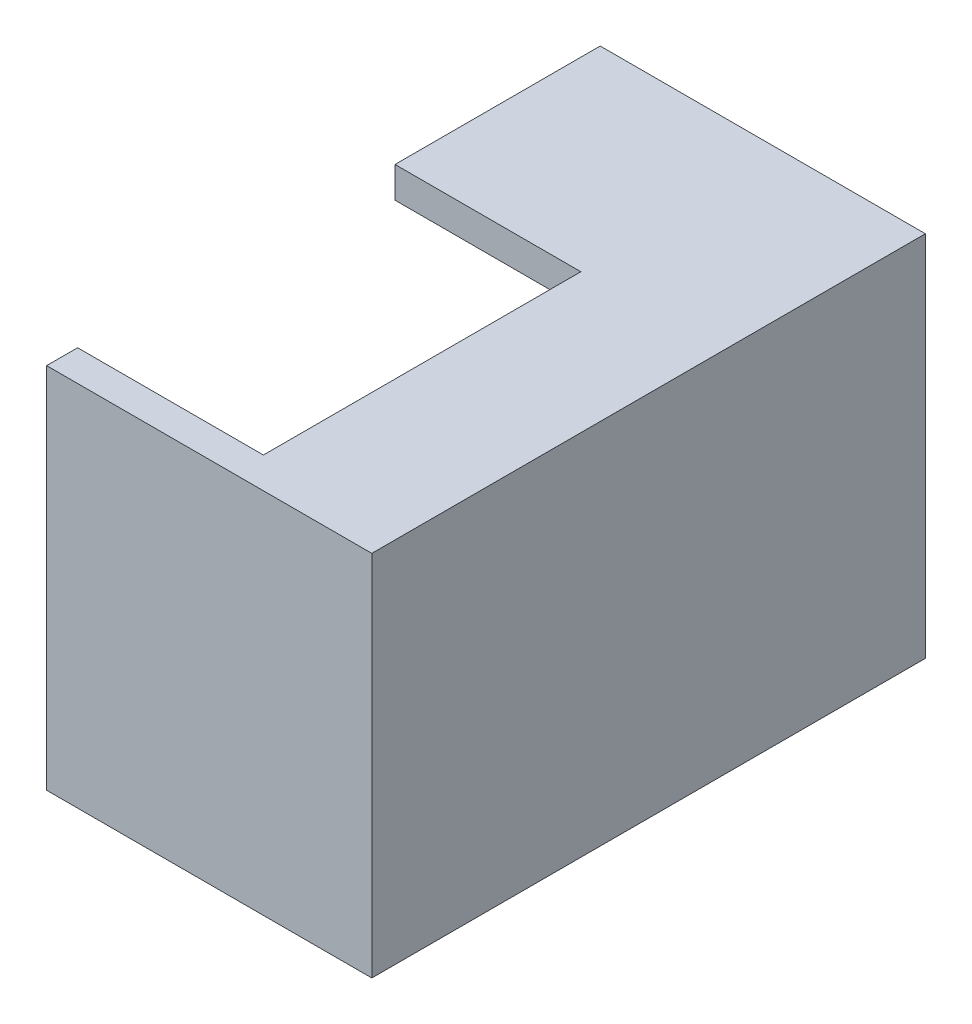
ISO-10303-21;
HEADER;
FILE_DESCRIPTION(('STEP AP214'),'2;1');
FILE_NAME('part.step','',(''),(''),'','','');
FILE_SCHEMA(('AUTOMOTIVE_DESIGN { 1 0 10303 214 1 1 1 1 }'));
ENDSEC;
DATA;
#1=APPLICATION_CONTEXT('core data for automotive mechanical design processes');
#2=APPLICATION_PROTOCOL_DEFINITION('international standard','automotive_design',2000,#1);
#3=PRODUCT_CONTEXT('',#1,'mechanical');
#4=PRODUCT('Part','Part','',(#3));
#5=PRODUCT_RELATED_PRODUCT_CATEGORY('part','',(#4));
#6=PRODUCT_DEFINITION_FORMATION('','',#4);
#7=PRODUCT_DEFINITION_CONTEXT('part definition',#1,'design');
#8=PRODUCT_DEFINITION('design','',#6,#7);
#9=PRODUCT_DEFINITION_SHAPE('','',#8);
#10=(LENGTH_UNIT() NAMED_UNIT(*) SI_UNIT(.MILLI.,.METRE.));
#11=(NAMED_UNIT(*) PLANE_ANGLE_UNIT() SI_UNIT($,.RADIAN.));
#12=(NAMED_UNIT(*) SI_UNIT($,.STERADIAN.) SOLID_ANGLE_UNIT());
#13=UNCERTAINTY_MEASURE_WITH_UNIT(LENGTH_MEASURE(1.E-05),#10,'distance_accuracy_value','');
#14=(GEOMETRIC_REPRESENTATION_CONTEXT(3) GLOBAL_UNCERTAINTY_ASSIGNED_CONTEXT((#13)) GLOBAL_UNIT_ASSIGNED_CONTEXT((#10,
#11,#12)) REPRESENTATION_CONTEXT('',''));
#15=CARTESIAN_POINT('',(0.,0.,0.));
#16=DIRECTION('',(0.,0.,1.));
#17=DIRECTION('',(1.,0.,0.));
#18=AXIS2_PLACEMENT_3D('',#15,#16,#17);
#19=CARTESIAN_POINT('',(19.,9.875,-17.875));
#20=DIRECTION('',(0.,0.,1.));
#21=DIRECTION('',(1.,0.,0.));
#22=AXIS2_PLACEMENT_3D('',#19,#20,#21);
#23=PLANE('',#22);
#24=DIRECTION('',(0.,1.,0.));
#25=VECTOR('',#24,1.);
#26=CARTESIAN_POINT('',(0.,9.875,-17.875));
#27=LINE('',#26,#25);
#28=CARTESIAN_POINT('',(0.,-11.875,-17.875));
#29=VERTEX_POINT('',#28);
#30=CARTESIAN_POINT('',(0.,11.875,-17.875));
#31=VERTEX_POINT('',#30);
#32=EDGE_CURVE('E149',#29,#31,#27,.T.);
#33=ORIENTED_EDGE('',*,*,#32,.T.);
#34=DIRECTION('',(-1.,0.,0.));
#35=VECTOR('',#34,1.);
#36=CARTESIAN_POINT('',(19.,11.875,-17.875));
#37=LINE('',#36,#35);
#38=CARTESIAN_POINT('',(21.,11.875,-17.875));
#39=VERTEX_POINT('',#38);
#40=EDGE_CURVE('E11',#39,#31,#37,.T.);
#41=ORIENTED_EDGE('',*,*,#40,.F.);
#42=DIRECTION('',(0.,1.,0.));
#43=VECTOR('',#42,1.);
#44=CARTESIAN_POINT('',(21.,9.875,-17.875));
#45=LINE('',#44,#43);
#46=CARTESIAN_POINT('',(21.,-11.875,-17.875));
#47=VERTEX_POINT('',#46);
#48=EDGE_CURVE('E124',#47,#39,#45,.T.);
#49=ORIENTED_EDGE('',*,*,#48,.F.);
#50=DIRECTION('',(-1.,0.,0.));
#51=VECTOR('',#50,1.);
#52=CARTESIAN_POINT('',(19.,-11.875,-17.875));
#53=LINE('',#52,#51);
#54=EDGE_CURVE('E145',#47,#29,#53,.T.);
#55=ORIENTED_EDGE('',*,*,#54,.T.);
#56=EDGE_LOOP('',(#33,#41,#49,#55));
#57=FACE_BOUND('',#56,.T.);
#58=ADVANCED_FACE('F43',(#57),#23,.F.);
#59=CARTESIAN_POINT('',(19.,11.875,15.875));
#60=DIRECTION('',(0.,-1.,0.));
#61=DIRECTION('',(0.,0.,-1.));
#62=AXIS2_PLACEMENT_3D('',#59,#60,#61);
#63=PLANE('',#62);
#64=DIRECTION('',(0.,0.,-1.));
#65=VECTOR('',#64,1.);
#66=CARTESIAN_POINT('',(12.,11.875,-4.625));
#67=LINE('',#66,#65);
#68=CARTESIAN_POINT('',(12.,11.875,15.875));
#69=VERTEX_POINT('',#68);
#70=CARTESIAN_POINT('',(12.,11.875,-4.625));
#71=VERTEX_POINT('',#70);
#72=EDGE_CURVE('E225',#69,#71,#67,.T.);
#73=ORIENTED_EDGE('',*,*,#72,.F.);
#74=DIRECTION('',(1.,0.,0.));
#75=VECTOR('',#74,1.);
#76=CARTESIAN_POINT('',(12.,11.875,15.875));
#77=LINE('',#76,#75);
#78=CARTESIAN_POINT('',(0.,11.875,15.875));
#79=VERTEX_POINT('',#78);
#80=EDGE_CURVE('E229',#79,#69,#77,.T.);
#81=ORIENTED_EDGE('',*,*,#80,.F.);
#82=DIRECTION('',(0.,0.,1.));
#83=VECTOR('',#82,1.);
#84=CARTESIAN_POINT('',(0.,11.875,15.875));
#85=LINE('',#84,#83);
#86=CARTESIAN_POINT('',(0.,11.875,17.875));
#87=VERTEX_POINT('',#86);
#88=EDGE_CURVE('E134',#79,#87,#85,.T.);
#89=ORIENTED_EDGE('',*,*,#88,.T.);
#90=DIRECTION('',(-1.,0.,0.));
#91=VECTOR('',#90,1.);
#92=CARTESIAN_POINT('',(19.,11.875,17.875));
#93=LINE('',#92,#91);
#94=CARTESIAN_POINT('',(21.,11.875,17.875));
#95=VERTEX_POINT('',#94);
#96=EDGE_CURVE('E53',#95,#87,#93,.T.);
#97=ORIENTED_EDGE('',*,*,#96,.F.);
#98=DIRECTION('',(0.,0.,1.));
#99=VECTOR('',#98,1.);
#100=CARTESIAN_POINT('',(21.,11.875,15.875));
#101=LINE('',#100,#99);
#102=EDGE_CURVE('E118',#39,#95,#101,.T.);
#103=ORIENTED_EDGE('',*,*,#102,.F.);
#104=ORIENTED_EDGE('',*,*,#40,.T.);
#105=CARTESIAN_POINT('',(0.,11.875,-4.625));
#106=VERTEX_POINT('',#105);
#107=EDGE_CURVE('E47',#31,#106,#85,.T.);
#108=ORIENTED_EDGE('',*,*,#107,.T.);
#109=DIRECTION('',(-1.,0.,0.));
#110=VECTOR('',#109,1.);
#111=CARTESIAN_POINT('',(0.,11.875,-4.625));
#112=LINE('',#111,#110);
#113=EDGE_CURVE('E221',#71,#106,#112,.T.);
#114=ORIENTED_EDGE('',*,*,#113,.F.);
#115=EDGE_LOOP('',(#73,#81,#89,#97,#103,#104,#108,#114));
#116=FACE_BOUND('',#115,.T.);
#117=ADVANCED_FACE('F131',(#116),#63,.F.);
#118=CARTESIAN_POINT('',(19.,9.875,17.875));
#119=DIRECTION('',(0.,0.,-1.));
#120=DIRECTION('',(0.,1.,0.));
#121=AXIS2_PLACEMENT_3D('',#118,#119,#120);
#122=PLANE('',#121);
#123=DIRECTION('',(0.,-1.,0.));
#124=VECTOR('',#123,1.);
#125=CARTESIAN_POINT('',(0.,9.875,17.875));
#126=LINE('',#125,#124);
#127=CARTESIAN_POINT('',(0.,-11.875,17.875));
#128=VERTEX_POINT('',#127);
#129=EDGE_CURVE('E156',#87,#128,#126,.T.);
#130=ORIENTED_EDGE('',*,*,#129,.T.);
#131=DIRECTION('',(-1.,0.,0.));
#132=VECTOR('',#131,1.);
#133=CARTESIAN_POINT('',(19.,-11.875,17.875));
#134=LINE('',#133,#132);
#135=CARTESIAN_POINT('',(21.,-11.875,17.875));
#136=VERTEX_POINT('',#135);
#137=EDGE_CURVE('E138',#136,#128,#134,.T.);
#138=ORIENTED_EDGE('',*,*,#137,.F.);
#139=DIRECTION('',(0.,-1.,0.));
#140=VECTOR('',#139,1.);
#141=CARTESIAN_POINT('',(21.,9.875,17.875));
#142=LINE('',#141,#140);
#143=EDGE_CURVE('E121',#95,#136,#142,.T.);
#144=ORIENTED_EDGE('',*,*,#143,.F.);
#145=ORIENTED_EDGE('',*,*,#96,.T.);
#146=EDGE_LOOP('',(#130,#138,#144,#145));
#147=FACE_BOUND('',#146,.T.);
#148=ADVANCED_FACE('F140',(#147),#122,.F.);
#149=CARTESIAN_POINT('',(19.,-11.875,15.875));
#150=DIRECTION('',(0.,1.,0.));
#151=DIRECTION('',(0.,0.,1.));
#152=AXIS2_PLACEMENT_3D('',#149,#150,#151);
#153=PLANE('',#152);
#154=DIRECTION('',(0.,0.,-1.));
#155=VECTOR('',#154,1.);
#156=CARTESIAN_POINT('',(0.,-11.875,15.875));
#157=LINE('',#156,#155);
#158=EDGE_CURVE('E154',#128,#29,#157,.T.);
#159=ORIENTED_EDGE('',*,*,#158,.T.);
#160=ORIENTED_EDGE('',*,*,#54,.F.);
#161=DIRECTION('',(0.,0.,-1.));
#162=VECTOR('',#161,1.);
#163=CARTESIAN_POINT('',(21.,-11.875,15.875));
#164=LINE('',#163,#162);
#165=EDGE_CURVE('E70',#136,#47,#164,.T.);
#166=ORIENTED_EDGE('',*,*,#165,.F.);
#167=ORIENTED_EDGE('',*,*,#137,.T.);
#168=EDGE_LOOP('',(#159,#160,#166,#167));
#169=FACE_BOUND('',#168,.T.);
#170=ADVANCED_FACE('F243',(#169),#153,.F.);
#171=CARTESIAN_POINT('',(21.,0.,0.));
#172=DIRECTION('',(1.,0.,0.));
#173=DIRECTION('',(0.,0.,-1.));
#174=AXIS2_PLACEMENT_3D('',#171,#172,#173);
#175=PLANE('',#174);
#176=ORIENTED_EDGE('',*,*,#48,.T.);
#177=ORIENTED_EDGE('',*,*,#102,.T.);
#178=ORIENTED_EDGE('',*,*,#143,.T.);
#179=ORIENTED_EDGE('',*,*,#165,.T.);
#180=EDGE_LOOP('',(#176,#177,#178,#179));
#181=FACE_BOUND('',#180,.T.);
#182=ADVANCED_FACE('F45',(#181),#175,.T.);
#183=CARTESIAN_POINT('',(0.,0.,0.));
#184=DIRECTION('',(1.,0.,0.));
#185=DIRECTION('',(0.,0.,-1.));
#186=AXIS2_PLACEMENT_3D('',#183,#184,#185);
#187=PLANE('',#186);
#188=ORIENTED_EDGE('',*,*,#88,.F.);
#189=DIRECTION('',(0.,-1.,0.));
#190=VECTOR('',#189,1.);
#191=CARTESIAN_POINT('',(0.,9.875,15.875));
#192=LINE('',#191,#190);
#193=CARTESIAN_POINT('',(0.,-9.875,15.875));
#194=VERTEX_POINT('',#193);
#195=EDGE_CURVE('E192',#79,#194,#192,.T.);
#196=ORIENTED_EDGE('',*,*,#195,.T.);
#197=DIRECTION('',(0.,0.,-1.));
#198=VECTOR('',#197,1.);
#199=CARTESIAN_POINT('',(0.,-9.875,15.875));
#200=LINE('',#199,#198);
#201=CARTESIAN_POINT('',(0.,-9.875,-15.875));
#202=VERTEX_POINT('',#201);
#203=EDGE_CURVE('E188',#194,#202,#200,.T.);
#204=ORIENTED_EDGE('',*,*,#203,.T.);
#205=DIRECTION('',(0.,1.,0.));
#206=VECTOR('',#205,1.);
#207=CARTESIAN_POINT('',(0.,9.875,-15.875));
#208=LINE('',#207,#206);
#209=CARTESIAN_POINT('',(0.,9.875,-15.875));
#210=VERTEX_POINT('',#209);
#211=EDGE_CURVE('E200',#202,#210,#208,.T.);
#212=ORIENTED_EDGE('',*,*,#211,.T.);
#213=DIRECTION('',(0.,0.,1.));
#214=VECTOR('',#213,1.);
#215=CARTESIAN_POINT('',(0.,9.875,15.875));
#216=LINE('',#215,#214);
#217=CARTESIAN_POINT('',(0.,9.875,-4.625));
#218=VERTEX_POINT('',#217);
#219=EDGE_CURVE('E196',#210,#218,#216,.T.);
#220=ORIENTED_EDGE('',*,*,#219,.T.);
#221=DIRECTION('',(0.,1.,0.));
#222=VECTOR('',#221,1.);
#223=CARTESIAN_POINT('',(0.,-13.8789470404394,-4.625));
#224=LINE('',#223,#222);
#225=EDGE_CURVE('E204',#218,#106,#224,.T.);
#226=ORIENTED_EDGE('',*,*,#225,.T.);
#227=ORIENTED_EDGE('',*,*,#107,.F.);
#228=ORIENTED_EDGE('',*,*,#32,.F.);
#229=ORIENTED_EDGE('',*,*,#158,.F.);
#230=ORIENTED_EDGE('',*,*,#129,.F.);
#231=EDGE_LOOP('',(#188,#196,#204,#212,#220,#226,#227,#228,#229,#230));
#232=FACE_BOUND('',#231,.T.);
#233=ADVANCED_FACE('F244',(#232),#187,.F.);
#234=CARTESIAN_POINT('',(19.,9.875,-15.875));
#235=DIRECTION('',(0.,0.,1.));
#236=DIRECTION('',(1.,0.,0.));
#237=AXIS2_PLACEMENT_3D('',#234,#235,#236);
#238=PLANE('',#237);
#239=ORIENTED_EDGE('',*,*,#211,.F.);
#240=DIRECTION('',(-1.,0.,0.));
#241=VECTOR('',#240,1.);
#242=CARTESIAN_POINT('',(19.,-9.875,-15.875));
#243=LINE('',#242,#241);
#244=CARTESIAN_POINT('',(19.,-9.875,-15.875));
#245=VERTEX_POINT('',#244);
#246=EDGE_CURVE('E172',#245,#202,#243,.T.);
#247=ORIENTED_EDGE('',*,*,#246,.F.);
#248=DIRECTION('',(0.,1.,0.));
#249=VECTOR('',#248,1.);
#250=CARTESIAN_POINT('',(19.,9.875,-15.875));
#251=LINE('',#250,#249);
#252=CARTESIAN_POINT('',(19.,9.875,-15.875));
#253=VERTEX_POINT('',#252);
#254=EDGE_CURVE('E184',#245,#253,#251,.T.);
#255=ORIENTED_EDGE('',*,*,#254,.T.);
#256=DIRECTION('',(-1.,0.,0.));
#257=VECTOR('',#256,1.);
#258=CARTESIAN_POINT('',(19.,9.875,-15.875));
#259=LINE('',#258,#257);
#260=EDGE_CURVE('E153',#253,#210,#259,.T.);
#261=ORIENTED_EDGE('',*,*,#260,.T.);
#262=EDGE_LOOP('',(#239,#247,#255,#261));
#263=FACE_BOUND('',#262,.T.);
#264=ADVANCED_FACE('F262',(#263),#238,.T.);
#265=CARTESIAN_POINT('',(19.,9.875,15.875));
#266=DIRECTION('',(0.,-1.,0.));
#267=DIRECTION('',(0.,0.,-1.));
#268=AXIS2_PLACEMENT_3D('',#265,#266,#267);
#269=PLANE('',#268);
#270=DIRECTION('',(0.,0.,-1.));
#271=VECTOR('',#270,1.);
#272=CARTESIAN_POINT('',(12.,9.875,-4.625));
#273=LINE('',#272,#271);
#274=CARTESIAN_POINT('',(12.,9.875,15.875));
#275=VERTEX_POINT('',#274);
#276=CARTESIAN_POINT('',(12.,9.875,-4.625));
#277=VERTEX_POINT('',#276);
#278=EDGE_CURVE('E215',#275,#277,#273,.T.);
#279=ORIENTED_EDGE('',*,*,#278,.T.);
#280=DIRECTION('',(-1.,0.,0.));
#281=VECTOR('',#280,1.);
#282=CARTESIAN_POINT('',(0.,9.875,-4.625));
#283=LINE('',#282,#281);
#284=EDGE_CURVE('E207',#277,#218,#283,.T.);
#285=ORIENTED_EDGE('',*,*,#284,.T.);
#286=ORIENTED_EDGE('',*,*,#219,.F.);
#287=ORIENTED_EDGE('',*,*,#260,.F.);
#288=DIRECTION('',(0.,0.,1.));
#289=VECTOR('',#288,1.);
#290=CARTESIAN_POINT('',(19.,9.875,15.875));
#291=LINE('',#290,#289);
#292=CARTESIAN_POINT('',(19.,9.875,15.875));
#293=VERTEX_POINT('',#292);
#294=EDGE_CURVE('E180',#253,#293,#291,.T.);
#295=ORIENTED_EDGE('',*,*,#294,.T.);
#296=DIRECTION('',(-1.,0.,0.));
#297=VECTOR('',#296,1.);
#298=CARTESIAN_POINT('',(19.,9.875,15.875));
#299=LINE('',#298,#297);
#300=EDGE_CURVE('E165',#293,#275,#299,.T.);
#301=ORIENTED_EDGE('',*,*,#300,.T.);
#302=EDGE_LOOP('',(#279,#285,#286,#287,#295,#301));
#303=FACE_BOUND('',#302,.T.);
#304=ADVANCED_FACE('F266',(#303),#269,.T.);
#305=CARTESIAN_POINT('',(19.,9.875,15.875));
#306=DIRECTION('',(0.,0.,-1.));
#307=DIRECTION('',(0.,1.,0.));
#308=AXIS2_PLACEMENT_3D('',#305,#306,#307);
#309=PLANE('',#308);
#310=ORIENTED_EDGE('',*,*,#195,.F.);
#311=ORIENTED_EDGE('',*,*,#80,.T.);
#312=DIRECTION('',(0.,1.,0.));
#313=VECTOR('',#312,1.);
#314=CARTESIAN_POINT('',(12.,-13.8789470404394,15.875));
#315=LINE('',#314,#313);
#316=EDGE_CURVE('E61',#275,#69,#315,.T.);
#317=ORIENTED_EDGE('',*,*,#316,.F.);
#318=ORIENTED_EDGE('',*,*,#300,.F.);
#319=DIRECTION('',(0.,-1.,0.));
#320=VECTOR('',#319,1.);
#321=CARTESIAN_POINT('',(19.,9.875,15.875));
#322=LINE('',#321,#320);
#323=CARTESIAN_POINT('',(19.,-9.875,15.875));
#324=VERTEX_POINT('',#323);
#325=EDGE_CURVE('E177',#293,#324,#322,.T.);
#326=ORIENTED_EDGE('',*,*,#325,.T.);
#327=DIRECTION('',(-1.,0.,0.));
#328=VECTOR('',#327,1.);
#329=CARTESIAN_POINT('',(19.,-9.875,15.875));
#330=LINE('',#329,#328);
#331=EDGE_CURVE('E169',#324,#194,#330,.T.);
#332=ORIENTED_EDGE('',*,*,#331,.T.);
#333=EDGE_LOOP('',(#310,#311,#317,#318,#326,#332));
#334=FACE_BOUND('',#333,.T.);
#335=ADVANCED_FACE('F271',(#334),#309,.T.);
#336=CARTESIAN_POINT('',(19.,-9.875,15.875));
#337=DIRECTION('',(0.,1.,0.));
#338=DIRECTION('',(0.,0.,1.));
#339=AXIS2_PLACEMENT_3D('',#336,#337,#338);
#340=PLANE('',#339);
#341=ORIENTED_EDGE('',*,*,#203,.F.);
#342=ORIENTED_EDGE('',*,*,#331,.F.);
#343=DIRECTION('',(0.,0.,-1.));
#344=VECTOR('',#343,1.);
#345=CARTESIAN_POINT('',(19.,-9.875,15.875));
#346=LINE('',#345,#344);
#347=EDGE_CURVE('E99',#324,#245,#346,.T.);
#348=ORIENTED_EDGE('',*,*,#347,.T.);
#349=ORIENTED_EDGE('',*,*,#246,.T.);
#350=EDGE_LOOP('',(#341,#342,#348,#349));
#351=FACE_BOUND('',#350,.T.);
#352=ADVANCED_FACE('F278',(#351),#340,.T.);
#353=CARTESIAN_POINT('',(19.,0.,0.));
#354=DIRECTION('',(1.,0.,0.));
#355=DIRECTION('',(0.,0.,-1.));
#356=AXIS2_PLACEMENT_3D('',#353,#354,#355);
#357=PLANE('',#356);
#358=ORIENTED_EDGE('',*,*,#254,.F.);
#359=ORIENTED_EDGE('',*,*,#347,.F.);
#360=ORIENTED_EDGE('',*,*,#325,.F.);
#361=ORIENTED_EDGE('',*,*,#294,.F.);
#362=EDGE_LOOP('',(#358,#359,#360,#361));
#363=FACE_BOUND('',#362,.T.);
#364=ADVANCED_FACE('F281',(#363),#357,.F.);
#365=CARTESIAN_POINT('',(12.,-13.8789470404394,-4.625));
#366=DIRECTION('',(1.,0.,0.));
#367=DIRECTION('',(0.,0.,-1.));
#368=AXIS2_PLACEMENT_3D('',#365,#366,#367);
#369=PLANE('',#368);
#370=ORIENTED_EDGE('',*,*,#316,.T.);
#371=ORIENTED_EDGE('',*,*,#72,.T.);
#372=DIRECTION('',(0.,1.,0.));
#373=VECTOR('',#372,1.);
#374=CARTESIAN_POINT('',(12.,-13.8789470404394,-4.625));
#375=LINE('',#374,#373);
#376=EDGE_CURVE('E211',#277,#71,#375,.T.);
#377=ORIENTED_EDGE('',*,*,#376,.F.);
#378=ORIENTED_EDGE('',*,*,#278,.F.);
#379=EDGE_LOOP('',(#370,#371,#377,#378));
#380=FACE_BOUND('',#379,.T.);
#381=ADVANCED_FACE('F284',(#380),#369,.F.);
#382=CARTESIAN_POINT('',(0.,-13.8789470404394,-4.625));
#383=DIRECTION('',(0.,0.,-1.));
#384=DIRECTION('',(-1.,0.,0.));
#385=AXIS2_PLACEMENT_3D('',#382,#383,#384);
#386=PLANE('',#385);
#387=ORIENTED_EDGE('',*,*,#376,.T.);
#388=ORIENTED_EDGE('',*,*,#113,.T.);
#389=ORIENTED_EDGE('',*,*,#225,.F.);
#390=ORIENTED_EDGE('',*,*,#284,.F.);
#391=EDGE_LOOP('',(#387,#388,#389,#390));
#392=FACE_BOUND('',#391,.T.);
#393=ADVANCED_FACE('F288',(#392),#386,.F.);
#394=CLOSED_SHELL('',(#58,#117,#148,#170,#182,#233,#264,#304,#335,#352,#364,#381,#393));
#395=MANIFOLD_SOLID_BREP('B2',#394);
#396=ADVANCED_BREP_SHAPE_REPRESENTATION('',(#18,#395),#14);
#397=SHAPE_DEFINITION_REPRESENTATION(#9,#396);
ENDSEC;
END-ISO-10303-21;
